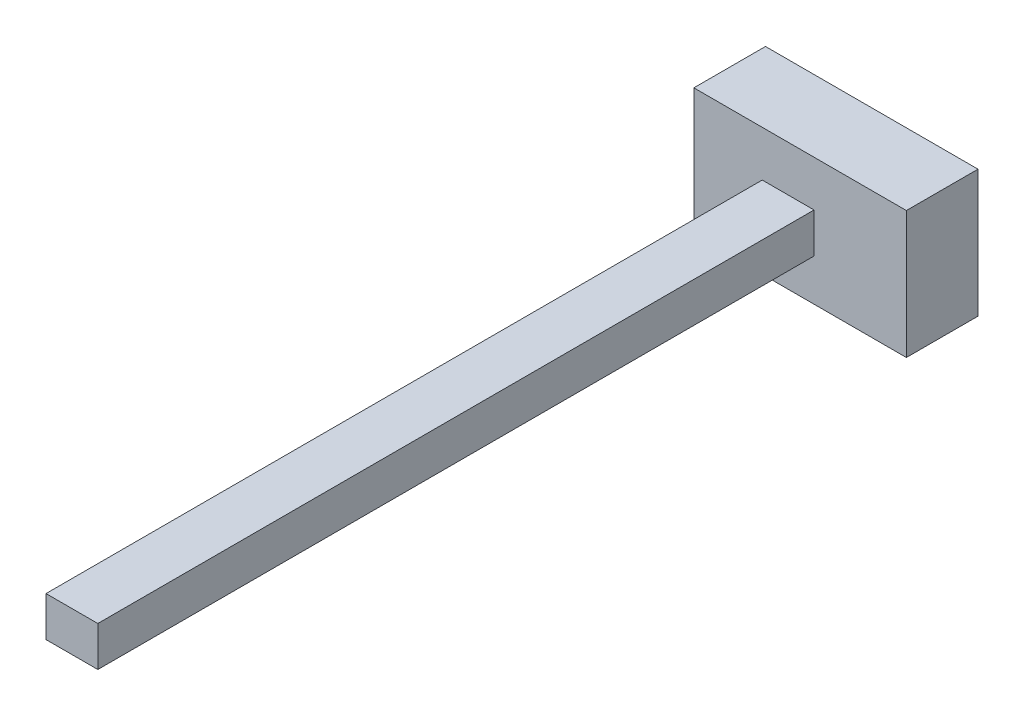
ISO-10303-21;
HEADER;
FILE_DESCRIPTION(('STEP AP214'),'2;1');
FILE_NAME('part.step','',(''),(''),'','','');
FILE_SCHEMA(('AUTOMOTIVE_DESIGN { 1 0 10303 214 1 1 1 1 }'));
ENDSEC;
DATA;
#1=APPLICATION_CONTEXT('core data for automotive mechanical design processes');
#2=APPLICATION_PROTOCOL_DEFINITION('international standard','automotive_design',2000,#1);
#3=PRODUCT_CONTEXT('',#1,'mechanical');
#4=PRODUCT('Part','Part','',(#3));
#5=PRODUCT_RELATED_PRODUCT_CATEGORY('part','',(#4));
#6=PRODUCT_DEFINITION_FORMATION('','',#4);
#7=PRODUCT_DEFINITION_CONTEXT('part definition',#1,'design');
#8=PRODUCT_DEFINITION('design','',#6,#7);
#9=PRODUCT_DEFINITION_SHAPE('','',#8);
#10=(LENGTH_UNIT() NAMED_UNIT(*) SI_UNIT(.MILLI.,.METRE.));
#11=(NAMED_UNIT(*) PLANE_ANGLE_UNIT() SI_UNIT($,.RADIAN.));
#12=(NAMED_UNIT(*) SI_UNIT($,.STERADIAN.) SOLID_ANGLE_UNIT());
#13=UNCERTAINTY_MEASURE_WITH_UNIT(LENGTH_MEASURE(1.E-05),#10,'distance_accuracy_value','');
#14=(GEOMETRIC_REPRESENTATION_CONTEXT(3) GLOBAL_UNCERTAINTY_ASSIGNED_CONTEXT((#13)) GLOBAL_UNIT_ASSIGNED_CONTEXT((#10,
#11,#12)) REPRESENTATION_CONTEXT('',''));
#15=CARTESIAN_POINT('',(0.,0.,0.));
#16=DIRECTION('',(0.,0.,1.));
#17=DIRECTION('',(1.,0.,0.));
#18=AXIS2_PLACEMENT_3D('',#15,#16,#17);
#19=CARTESIAN_POINT('',(0.,0.,10.));
#20=DIRECTION('',(0.,0.,-1.));
#21=DIRECTION('',(-1.,0.,0.));
#22=AXIS2_PLACEMENT_3D('',#19,#20,#21);
#23=PLANE('',#22);
#24=DIRECTION('',(0.,-1.,0.));
#25=VECTOR('',#24,1.);
#26=CARTESIAN_POINT('',(0.,0.,10.));
#27=LINE('',#26,#25);
#28=CARTESIAN_POINT('',(0.,17.7758451472192,10.));
#29=VERTEX_POINT('',#28);
#30=CARTESIAN_POINT('',(0.,0.,10.));
#31=VERTEX_POINT('',#30);
#32=EDGE_CURVE('E139',#29,#31,#27,.T.);
#33=ORIENTED_EDGE('',*,*,#32,.T.);
#34=DIRECTION('',(1.,0.,0.));
#35=VECTOR('',#34,1.);
#36=CARTESIAN_POINT('',(0.,0.,10.));
#37=LINE('',#36,#35);
#38=CARTESIAN_POINT('',(29.6709199368479,0.,10.));
#39=VERTEX_POINT('',#38);
#40=EDGE_CURVE('E143',#31,#39,#37,.T.);
#41=ORIENTED_EDGE('',*,*,#40,.T.);
#42=DIRECTION('',(0.,1.,0.));
#43=VECTOR('',#42,1.);
#44=CARTESIAN_POINT('',(29.6709199368479,0.,10.));
#45=LINE('',#44,#43);
#46=CARTESIAN_POINT('',(29.6709199368479,17.7758451472192,10.));
#47=VERTEX_POINT('',#46);
#48=EDGE_CURVE('E147',#39,#47,#45,.T.);
#49=ORIENTED_EDGE('',*,*,#48,.T.);
#50=DIRECTION('',(-1.,0.,0.));
#51=VECTOR('',#50,1.);
#52=CARTESIAN_POINT('',(0.,17.7758451472192,10.));
#53=LINE('',#52,#51);
#54=EDGE_CURVE('E150',#47,#29,#53,.T.);
#55=ORIENTED_EDGE('',*,*,#54,.T.);
#56=EDGE_LOOP('',(#33,#41,#49,#55));
#57=FACE_BOUND('',#56,.T.);
#58=DIRECTION('',(0.,-1.,0.));
#59=VECTOR('',#58,1.);
#60=CARTESIAN_POINT('',(9.54694630024733,11.3991175022647,10.));
#61=LINE('',#60,#59);
#62=CARTESIAN_POINT('',(9.54694630024733,11.3991175022647,10.));
#63=VERTEX_POINT('',#62);
#64=CARTESIAN_POINT('',(9.54694630024733,5.83105860943078,10.));
#65=VERTEX_POINT('',#64);
#66=EDGE_CURVE('E55',#63,#65,#61,.T.);
#67=ORIENTED_EDGE('',*,*,#66,.F.);
#68=DIRECTION('',(-1.,0.,0.));
#69=VECTOR('',#68,1.);
#70=CARTESIAN_POINT('',(9.54694630024733,11.3991175022647,10.));
#71=LINE('',#70,#69);
#72=CARTESIAN_POINT('',(16.7831305777781,11.3991175022647,10.));
#73=VERTEX_POINT('',#72);
#74=EDGE_CURVE('E59',#73,#63,#71,.T.);
#75=ORIENTED_EDGE('',*,*,#74,.F.);
#76=DIRECTION('',(0.,1.,0.));
#77=VECTOR('',#76,1.);
#78=CARTESIAN_POINT('',(16.7831305777781,11.3991175022647,10.));
#79=LINE('',#78,#77);
#80=CARTESIAN_POINT('',(16.7831305777781,5.83105860943078,10.));
#81=VERTEX_POINT('',#80);
#82=EDGE_CURVE('E265',#81,#73,#79,.T.);
#83=ORIENTED_EDGE('',*,*,#82,.F.);
#84=DIRECTION('',(1.,0.,0.));
#85=VECTOR('',#84,1.);
#86=CARTESIAN_POINT('',(9.54694630024733,5.83105860943078,10.));
#87=LINE('',#86,#85);
#88=EDGE_CURVE('E275',#65,#81,#87,.T.);
#89=ORIENTED_EDGE('',*,*,#88,.F.);
#90=EDGE_LOOP('',(#67,#75,#83,#89));
#91=FACE_BOUND('',#90,.T.);
#92=ADVANCED_FACE('F39',(#57,#91),#23,.F.);
#93=CARTESIAN_POINT('',(0.,0.,10.));
#94=DIRECTION('',(1.,0.,0.));
#95=DIRECTION('',(0.,0.,-1.));
#96=AXIS2_PLACEMENT_3D('',#93,#94,#95);
#97=PLANE('',#96);
#98=DIRECTION('',(0.,-1.,0.));
#99=VECTOR('',#98,1.);
#100=CARTESIAN_POINT('',(0.,0.,0.));
#101=LINE('',#100,#99);
#102=CARTESIAN_POINT('',(0.,17.7758451472192,0.));
#103=VERTEX_POINT('',#102);
#104=CARTESIAN_POINT('',(0.,0.,0.));
#105=VERTEX_POINT('',#104);
#106=EDGE_CURVE('E128',#103,#105,#101,.T.);
#107=ORIENTED_EDGE('',*,*,#106,.T.);
#108=DIRECTION('',(0.,0.,-1.));
#109=VECTOR('',#108,1.);
#110=CARTESIAN_POINT('',(0.,0.,10.));
#111=LINE('',#110,#109);
#112=EDGE_CURVE('E11',#31,#105,#111,.T.);
#113=ORIENTED_EDGE('',*,*,#112,.F.);
#114=ORIENTED_EDGE('',*,*,#32,.F.);
#115=DIRECTION('',(0.,0.,-1.));
#116=VECTOR('',#115,1.);
#117=CARTESIAN_POINT('',(0.,17.7758451472192,10.));
#118=LINE('',#117,#116);
#119=EDGE_CURVE('E152',#29,#103,#118,.T.);
#120=ORIENTED_EDGE('',*,*,#119,.T.);
#121=EDGE_LOOP('',(#107,#113,#114,#120));
#122=FACE_BOUND('',#121,.T.);
#123=ADVANCED_FACE('F41',(#122),#97,.F.);
#124=CARTESIAN_POINT('',(0.,0.,10.));
#125=DIRECTION('',(0.,1.,0.));
#126=DIRECTION('',(0.,0.,1.));
#127=AXIS2_PLACEMENT_3D('',#124,#125,#126);
#128=PLANE('',#127);
#129=DIRECTION('',(1.,0.,0.));
#130=VECTOR('',#129,1.);
#131=CARTESIAN_POINT('',(0.,0.,0.));
#132=LINE('',#131,#130);
#133=CARTESIAN_POINT('',(29.6709199368479,0.,0.));
#134=VERTEX_POINT('',#133);
#135=EDGE_CURVE('E133',#105,#134,#132,.T.);
#136=ORIENTED_EDGE('',*,*,#135,.T.);
#137=DIRECTION('',(0.,0.,-1.));
#138=VECTOR('',#137,1.);
#139=CARTESIAN_POINT('',(29.6709199368479,0.,10.));
#140=LINE('',#139,#138);
#141=EDGE_CURVE('E48',#39,#134,#140,.T.);
#142=ORIENTED_EDGE('',*,*,#141,.F.);
#143=ORIENTED_EDGE('',*,*,#40,.F.);
#144=ORIENTED_EDGE('',*,*,#112,.T.);
#145=EDGE_LOOP('',(#136,#142,#143,#144));
#146=FACE_BOUND('',#145,.T.);
#147=ADVANCED_FACE('F188',(#146),#128,.F.);
#148=CARTESIAN_POINT('',(29.6709199368479,0.,10.));
#149=DIRECTION('',(-1.,0.,0.));
#150=DIRECTION('',(0.,0.,1.));
#151=AXIS2_PLACEMENT_3D('',#148,#149,#150);
#152=PLANE('',#151);
#153=DIRECTION('',(0.,1.,0.));
#154=VECTOR('',#153,1.);
#155=CARTESIAN_POINT('',(29.6709199368479,0.,0.));
#156=LINE('',#155,#154);
#157=CARTESIAN_POINT('',(29.6709199368479,17.7758451472192,0.));
#158=VERTEX_POINT('',#157);
#159=EDGE_CURVE('E156',#134,#158,#156,.T.);
#160=ORIENTED_EDGE('',*,*,#159,.T.);
#161=DIRECTION('',(0.,0.,-1.));
#162=VECTOR('',#161,1.);
#163=CARTESIAN_POINT('',(29.6709199368479,17.7758451472192,10.));
#164=LINE('',#163,#162);
#165=EDGE_CURVE('E164',#47,#158,#164,.T.);
#166=ORIENTED_EDGE('',*,*,#165,.F.);
#167=ORIENTED_EDGE('',*,*,#48,.F.);
#168=ORIENTED_EDGE('',*,*,#141,.T.);
#169=EDGE_LOOP('',(#160,#166,#167,#168));
#170=FACE_BOUND('',#169,.T.);
#171=ADVANCED_FACE('F173',(#170),#152,.F.);
#172=CARTESIAN_POINT('',(0.,17.7758451472192,10.));
#173=DIRECTION('',(0.,-1.,0.));
#174=DIRECTION('',(0.,0.,-1.));
#175=AXIS2_PLACEMENT_3D('',#172,#173,#174);
#176=PLANE('',#175);
#177=DIRECTION('',(-1.,0.,0.));
#178=VECTOR('',#177,1.);
#179=CARTESIAN_POINT('',(0.,17.7758451472192,0.));
#180=LINE('',#179,#178);
#181=EDGE_CURVE('E144',#158,#103,#180,.T.);
#182=ORIENTED_EDGE('',*,*,#181,.T.);
#183=ORIENTED_EDGE('',*,*,#119,.F.);
#184=ORIENTED_EDGE('',*,*,#54,.F.);
#185=ORIENTED_EDGE('',*,*,#165,.T.);
#186=EDGE_LOOP('',(#182,#183,#184,#185));
#187=FACE_BOUND('',#186,.T.);
#188=ADVANCED_FACE('F182',(#187),#176,.F.);
#189=CARTESIAN_POINT('',(0.,0.,0.));
#190=DIRECTION('',(0.,0.,-1.));
#191=DIRECTION('',(-1.,0.,0.));
#192=AXIS2_PLACEMENT_3D('',#189,#190,#191);
#193=PLANE('',#192);
#194=ORIENTED_EDGE('',*,*,#106,.F.);
#195=ORIENTED_EDGE('',*,*,#181,.F.);
#196=ORIENTED_EDGE('',*,*,#159,.F.);
#197=ORIENTED_EDGE('',*,*,#135,.F.);
#198=EDGE_LOOP('',(#194,#195,#196,#197));
#199=FACE_BOUND('',#198,.T.);
#200=ADVANCED_FACE('F179',(#199),#193,.T.);
#201=CARTESIAN_POINT('',(9.54694630024733,11.3991175022647,110.));
#202=DIRECTION('',(1.,0.,0.));
#203=DIRECTION('',(0.,0.,-1.));
#204=AXIS2_PLACEMENT_3D('',#201,#202,#203);
#205=PLANE('',#204);
#206=ORIENTED_EDGE('',*,*,#66,.T.);
#207=DIRECTION('',(0.,0.,-1.));
#208=VECTOR('',#207,1.);
#209=CARTESIAN_POINT('',(9.54694630024733,5.83105860943078,110.));
#210=LINE('',#209,#208);
#211=CARTESIAN_POINT('',(9.54694630024733,5.83105860943078,110.));
#212=VERTEX_POINT('',#211);
#213=EDGE_CURVE('E108',#212,#65,#210,.T.);
#214=ORIENTED_EDGE('',*,*,#213,.F.);
#215=DIRECTION('',(0.,-1.,0.));
#216=VECTOR('',#215,1.);
#217=CARTESIAN_POINT('',(9.54694630024733,11.3991175022647,110.));
#218=LINE('',#217,#216);
#219=CARTESIAN_POINT('',(9.54694630024733,11.3991175022647,110.));
#220=VERTEX_POINT('',#219);
#221=EDGE_CURVE('E115',#220,#212,#218,.T.);
#222=ORIENTED_EDGE('',*,*,#221,.F.);
#223=DIRECTION('',(0.,0.,-1.));
#224=VECTOR('',#223,1.);
#225=CARTESIAN_POINT('',(9.54694630024733,11.3991175022647,110.));
#226=LINE('',#225,#224);
#227=EDGE_CURVE('E262',#220,#63,#226,.T.);
#228=ORIENTED_EDGE('',*,*,#227,.T.);
#229=EDGE_LOOP('',(#206,#214,#222,#228));
#230=FACE_BOUND('',#229,.T.);
#231=ADVANCED_FACE('F126',(#230),#205,.F.);
#232=CARTESIAN_POINT('',(9.54694630024733,5.83105860943078,110.));
#233=DIRECTION('',(0.,1.,0.));
#234=DIRECTION('',(0.,0.,1.));
#235=AXIS2_PLACEMENT_3D('',#232,#233,#234);
#236=PLANE('',#235);
#237=ORIENTED_EDGE('',*,*,#88,.T.);
#238=DIRECTION('',(0.,0.,-1.));
#239=VECTOR('',#238,1.);
#240=CARTESIAN_POINT('',(16.7831305777781,5.83105860943078,110.));
#241=LINE('',#240,#239);
#242=CARTESIAN_POINT('',(16.7831305777781,5.83105860943078,110.));
#243=VERTEX_POINT('',#242);
#244=EDGE_CURVE('E110',#243,#81,#241,.T.);
#245=ORIENTED_EDGE('',*,*,#244,.F.);
#246=DIRECTION('',(1.,0.,0.));
#247=VECTOR('',#246,1.);
#248=CARTESIAN_POINT('',(9.54694630024733,5.83105860943078,110.));
#249=LINE('',#248,#247);
#250=EDGE_CURVE('E103',#212,#243,#249,.T.);
#251=ORIENTED_EDGE('',*,*,#250,.F.);
#252=ORIENTED_EDGE('',*,*,#213,.T.);
#253=EDGE_LOOP('',(#237,#245,#251,#252));
#254=FACE_BOUND('',#253,.T.);
#255=ADVANCED_FACE('F106',(#254),#236,.F.);
#256=CARTESIAN_POINT('',(16.7831305777781,11.3991175022647,110.));
#257=DIRECTION('',(-1.,0.,0.));
#258=DIRECTION('',(0.,0.,1.));
#259=AXIS2_PLACEMENT_3D('',#256,#257,#258);
#260=PLANE('',#259);
#261=ORIENTED_EDGE('',*,*,#82,.T.);
#262=DIRECTION('',(0.,0.,-1.));
#263=VECTOR('',#262,1.);
#264=CARTESIAN_POINT('',(16.7831305777781,11.3991175022647,110.));
#265=LINE('',#264,#263);
#266=CARTESIAN_POINT('',(16.7831305777781,11.3991175022647,110.));
#267=VERTEX_POINT('',#266);
#268=EDGE_CURVE('E135',#267,#73,#265,.T.);
#269=ORIENTED_EDGE('',*,*,#268,.F.);
#270=DIRECTION('',(0.,1.,0.));
#271=VECTOR('',#270,1.);
#272=CARTESIAN_POINT('',(16.7831305777781,11.3991175022647,110.));
#273=LINE('',#272,#271);
#274=EDGE_CURVE('E114',#243,#267,#273,.T.);
#275=ORIENTED_EDGE('',*,*,#274,.F.);
#276=ORIENTED_EDGE('',*,*,#244,.T.);
#277=EDGE_LOOP('',(#261,#269,#275,#276));
#278=FACE_BOUND('',#277,.T.);
#279=ADVANCED_FACE('F228',(#278),#260,.F.);
#280=CARTESIAN_POINT('',(9.54694630024733,11.3991175022647,110.));
#281=DIRECTION('',(0.,-1.,0.));
#282=DIRECTION('',(0.,0.,-1.));
#283=AXIS2_PLACEMENT_3D('',#280,#281,#282);
#284=PLANE('',#283);
#285=ORIENTED_EDGE('',*,*,#74,.T.);
#286=ORIENTED_EDGE('',*,*,#227,.F.);
#287=DIRECTION('',(-1.,0.,0.));
#288=VECTOR('',#287,1.);
#289=CARTESIAN_POINT('',(9.54694630024733,11.3991175022647,110.));
#290=LINE('',#289,#288);
#291=EDGE_CURVE('E120',#267,#220,#290,.T.);
#292=ORIENTED_EDGE('',*,*,#291,.F.);
#293=ORIENTED_EDGE('',*,*,#268,.T.);
#294=EDGE_LOOP('',(#285,#286,#292,#293));
#295=FACE_BOUND('',#294,.T.);
#296=ADVANCED_FACE('F234',(#295),#284,.F.);
#297=CARTESIAN_POINT('',(0.,0.,110.));
#298=DIRECTION('',(0.,0.,1.));
#299=DIRECTION('',(1.,0.,0.));
#300=AXIS2_PLACEMENT_3D('',#297,#298,#299);
#301=PLANE('',#300);
#302=ORIENTED_EDGE('',*,*,#221,.T.);
#303=ORIENTED_EDGE('',*,*,#250,.T.);
#304=ORIENTED_EDGE('',*,*,#274,.T.);
#305=ORIENTED_EDGE('',*,*,#291,.T.);
#306=EDGE_LOOP('',(#302,#303,#304,#305));
#307=FACE_BOUND('',#306,.T.);
#308=ADVANCED_FACE('F118',(#307),#301,.T.);
#309=CLOSED_SHELL('',(#92,#123,#147,#171,#188,#200,#231,#255,#279,#296,#308));
#310=MANIFOLD_SOLID_BREP('B2',#309);
#311=ADVANCED_BREP_SHAPE_REPRESENTATION('',(#18,#310),#14);
#312=SHAPE_DEFINITION_REPRESENTATION(#9,#311);
ENDSEC;
END-ISO-10303-21;
